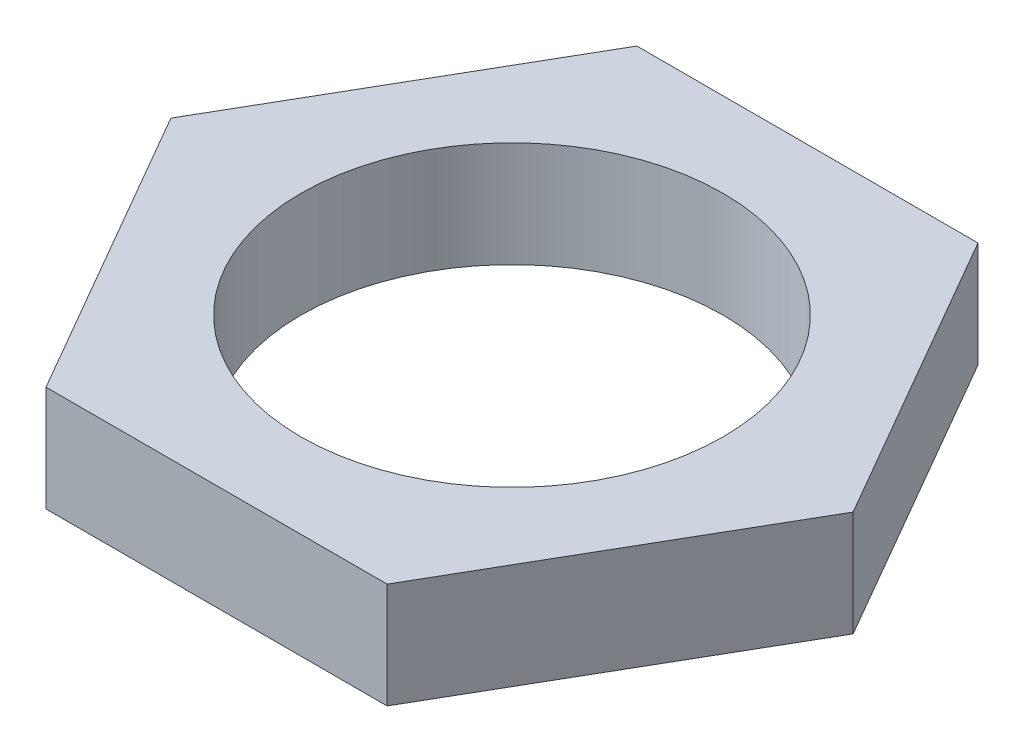
ISO-10303-21;
HEADER;
FILE_DESCRIPTION(('STEP AP214'),'2;1');
FILE_NAME('part.step','',(''),(''),'','','');
FILE_SCHEMA(('AUTOMOTIVE_DESIGN { 1 0 10303 214 1 1 1 1 }'));
ENDSEC;
DATA;
#1=APPLICATION_CONTEXT('core data for automotive mechanical design processes');
#2=APPLICATION_PROTOCOL_DEFINITION('international standard','automotive_design',2000,#1);
#3=PRODUCT_CONTEXT('',#1,'mechanical');
#4=PRODUCT('Part','Part','',(#3));
#5=PRODUCT_RELATED_PRODUCT_CATEGORY('part','',(#4));
#6=PRODUCT_DEFINITION_FORMATION('','',#4);
#7=PRODUCT_DEFINITION_CONTEXT('part definition',#1,'design');
#8=PRODUCT_DEFINITION('design','',#6,#7);
#9=PRODUCT_DEFINITION_SHAPE('','',#8);
#10=(LENGTH_UNIT() NAMED_UNIT(*) SI_UNIT(.MILLI.,.METRE.));
#11=(NAMED_UNIT(*) PLANE_ANGLE_UNIT() SI_UNIT($,.RADIAN.));
#12=(NAMED_UNIT(*) SI_UNIT($,.STERADIAN.) SOLID_ANGLE_UNIT());
#13=UNCERTAINTY_MEASURE_WITH_UNIT(LENGTH_MEASURE(1.E-05),#10,'distance_accuracy_value','');
#14=(GEOMETRIC_REPRESENTATION_CONTEXT(3) GLOBAL_UNCERTAINTY_ASSIGNED_CONTEXT((#13)) GLOBAL_UNIT_ASSIGNED_CONTEXT((#10,
#11,#12)) REPRESENTATION_CONTEXT('',''));
#15=CARTESIAN_POINT('',(0.,0.,0.));
#16=DIRECTION('',(0.,0.,1.));
#17=DIRECTION('',(1.,0.,0.));
#18=AXIS2_PLACEMENT_3D('',#15,#16,#17);
#19=CARTESIAN_POINT('',(0.,1.25,0.));
#20=DIRECTION('',(0.,1.,0.));
#21=DIRECTION('',(0.,0.,1.));
#22=AXIS2_PLACEMENT_3D('',#19,#20,#21);
#23=PLANE('',#22);
#24=DIRECTION('',(0.499999999999995,0.,-0.866025403784441));
#25=VECTOR('',#24,1.);
#26=CARTESIAN_POINT('',(4.04145188432746,1.25,6.99999999999996));
#27=LINE('',#26,#25);
#28=CARTESIAN_POINT('',(4.04145188432746,1.25,6.99999999999996));
#29=VERTEX_POINT('',#28);
#30=CARTESIAN_POINT('',(8.08290376865476,1.25,0.));
#31=VERTEX_POINT('',#30);
#32=EDGE_CURVE('E126',#29,#31,#27,.T.);
#33=ORIENTED_EDGE('',*,*,#32,.T.);
#34=DIRECTION('',(-0.500000000000001,0.,-0.866025403784438));
#35=VECTOR('',#34,1.);
#36=CARTESIAN_POINT('',(8.08290376865476,1.25,0.));
#37=LINE('',#36,#35);
#38=CARTESIAN_POINT('',(4.04145188432737,1.25,-7.00000000000001));
#39=VERTEX_POINT('',#38);
#40=EDGE_CURVE('E84',#31,#39,#37,.T.);
#41=ORIENTED_EDGE('',*,*,#40,.T.);
#42=DIRECTION('',(-1.,0.,0.));
#43=VECTOR('',#42,1.);
#44=CARTESIAN_POINT('',(4.04145188432737,1.25,-7.00000000000001));
#45=LINE('',#44,#43);
#46=CARTESIAN_POINT('',(-4.04145188432742,1.25,-6.99999999999998));
#47=VERTEX_POINT('',#46);
#48=EDGE_CURVE('E97',#39,#47,#45,.T.);
#49=ORIENTED_EDGE('',*,*,#48,.T.);
#50=DIRECTION('',(-0.499999999999995,0.,0.866025403784441));
#51=VECTOR('',#50,1.);
#52=CARTESIAN_POINT('',(-4.04145188432742,1.25,-6.99999999999998));
#53=LINE('',#52,#51);
#54=CARTESIAN_POINT('',(-8.08290376865476,1.25,0.));
#55=VERTEX_POINT('',#54);
#56=EDGE_CURVE('E91',#47,#55,#53,.T.);
#57=ORIENTED_EDGE('',*,*,#56,.T.);
#58=DIRECTION('',(0.500000000000007,0.,0.866025403784435));
#59=VECTOR('',#58,1.);
#60=CARTESIAN_POINT('',(-8.08290376865476,1.25,0.));
#61=LINE('',#60,#59);
#62=CARTESIAN_POINT('',(-4.04145188432732,1.25,7.00000000000004));
#63=VERTEX_POINT('',#62);
#64=EDGE_CURVE('E95',#55,#63,#61,.T.);
#65=ORIENTED_EDGE('',*,*,#64,.T.);
#66=DIRECTION('',(1.,0.,0.));
#67=VECTOR('',#66,1.);
#68=CARTESIAN_POINT('',(-4.04145188432732,1.25,7.00000000000004));
#69=LINE('',#68,#67);
#70=EDGE_CURVE('E47',#63,#29,#69,.T.);
#71=ORIENTED_EDGE('',*,*,#70,.T.);
#72=EDGE_LOOP('',(#33,#41,#49,#57,#65,#71));
#73=FACE_BOUND('',#72,.T.);
#74=CARTESIAN_POINT('',(0.,1.25,0.));
#75=DIRECTION('',(0.,1.,0.));
#76=DIRECTION('',(0.,0.,1.));
#77=AXIS2_PLACEMENT_3D('',#74,#75,#76);
#78=CIRCLE('',#77,5.);
#79=CARTESIAN_POINT('',(0.,1.25,5.));
#80=VERTEX_POINT('',#79);
#81=EDGE_CURVE('E119',#80,#80,#78,.T.);
#82=ORIENTED_EDGE('',*,*,#81,.F.);
#83=EDGE_LOOP('',(#82));
#84=FACE_BOUND('',#83,.T.);
#85=ADVANCED_FACE('F30',(#73,#84),#23,.T.);
#86=CARTESIAN_POINT('',(0.,-1.25,0.));
#87=DIRECTION('',(0.,1.,0.));
#88=DIRECTION('',(0.,0.,1.));
#89=AXIS2_PLACEMENT_3D('',#86,#87,#88);
#90=PLANE('',#89);
#91=DIRECTION('',(0.499999999999995,0.,-0.866025403784441));
#92=VECTOR('',#91,1.);
#93=CARTESIAN_POINT('',(4.04145188432746,-1.25,6.99999999999996));
#94=LINE('',#93,#92);
#95=CARTESIAN_POINT('',(4.04145188432746,-1.25,6.99999999999996));
#96=VERTEX_POINT('',#95);
#97=CARTESIAN_POINT('',(8.08290376865476,-1.25,0.));
#98=VERTEX_POINT('',#97);
#99=EDGE_CURVE('E115',#96,#98,#94,.T.);
#100=ORIENTED_EDGE('',*,*,#99,.F.);
#101=DIRECTION('',(1.,0.,0.));
#102=VECTOR('',#101,1.);
#103=CARTESIAN_POINT('',(-4.04145188432732,-1.25,7.00000000000004));
#104=LINE('',#103,#102);
#105=CARTESIAN_POINT('',(-4.04145188432732,-1.25,7.00000000000004));
#106=VERTEX_POINT('',#105);
#107=EDGE_CURVE('E76',#106,#96,#104,.T.);
#108=ORIENTED_EDGE('',*,*,#107,.F.);
#109=DIRECTION('',(0.500000000000007,0.,0.866025403784435));
#110=VECTOR('',#109,1.);
#111=CARTESIAN_POINT('',(-8.08290376865476,-1.25,0.));
#112=LINE('',#111,#110);
#113=CARTESIAN_POINT('',(-8.08290376865476,-1.25,0.));
#114=VERTEX_POINT('',#113);
#115=EDGE_CURVE('E70',#114,#106,#112,.T.);
#116=ORIENTED_EDGE('',*,*,#115,.F.);
#117=DIRECTION('',(-0.499999999999995,0.,0.866025403784441));
#118=VECTOR('',#117,1.);
#119=CARTESIAN_POINT('',(-4.04145188432742,-1.25,-6.99999999999998));
#120=LINE('',#119,#118);
#121=CARTESIAN_POINT('',(-4.04145188432742,-1.25,-6.99999999999998));
#122=VERTEX_POINT('',#121);
#123=EDGE_CURVE('E105',#122,#114,#120,.T.);
#124=ORIENTED_EDGE('',*,*,#123,.F.);
#125=DIRECTION('',(-1.,0.,0.));
#126=VECTOR('',#125,1.);
#127=CARTESIAN_POINT('',(4.04145188432737,-1.25,-7.00000000000001));
#128=LINE('',#127,#126);
#129=CARTESIAN_POINT('',(4.04145188432737,-1.25,-7.00000000000001));
#130=VERTEX_POINT('',#129);
#131=EDGE_CURVE('E121',#130,#122,#128,.T.);
#132=ORIENTED_EDGE('',*,*,#131,.F.);
#133=DIRECTION('',(-0.500000000000001,0.,-0.866025403784438));
#134=VECTOR('',#133,1.);
#135=CARTESIAN_POINT('',(8.08290376865476,-1.25,0.));
#136=LINE('',#135,#134);
#137=EDGE_CURVE('E118',#98,#130,#136,.T.);
#138=ORIENTED_EDGE('',*,*,#137,.F.);
#139=EDGE_LOOP('',(#100,#108,#116,#124,#132,#138));
#140=FACE_BOUND('',#139,.T.);
#141=CARTESIAN_POINT('',(0.,-1.25,0.));
#142=DIRECTION('',(0.,1.,0.));
#143=DIRECTION('',(0.,0.,1.));
#144=AXIS2_PLACEMENT_3D('',#141,#142,#143);
#145=CIRCLE('',#144,5.);
#146=CARTESIAN_POINT('',(0.,-1.25,5.));
#147=VERTEX_POINT('',#146);
#148=EDGE_CURVE('E219',#147,#147,#145,.T.);
#149=ORIENTED_EDGE('',*,*,#148,.T.);
#150=EDGE_LOOP('',(#149));
#151=FACE_BOUND('',#150,.T.);
#152=ADVANCED_FACE('F135',(#140,#151),#90,.F.);
#153=CARTESIAN_POINT('',(4.04145188432746,1.25,6.99999999999996));
#154=DIRECTION('',(-0.866025403784442,0.,-0.499999999999995));
#155=DIRECTION('',(-0.499999999999995,0.,0.866025403784442));
#156=AXIS2_PLACEMENT_3D('',#153,#154,#155);
#157=PLANE('',#156);
#158=ORIENTED_EDGE('',*,*,#99,.T.);
#159=DIRECTION('',(0.,-1.,0.));
#160=VECTOR('',#159,1.);
#161=CARTESIAN_POINT('',(8.08290376865476,1.25,0.));
#162=LINE('',#161,#160);
#163=EDGE_CURVE('E11',#31,#98,#162,.T.);
#164=ORIENTED_EDGE('',*,*,#163,.F.);
#165=ORIENTED_EDGE('',*,*,#32,.F.);
#166=DIRECTION('',(0.,-1.,0.));
#167=VECTOR('',#166,1.);
#168=CARTESIAN_POINT('',(4.04145188432746,1.25,6.99999999999996));
#169=LINE('',#168,#167);
#170=EDGE_CURVE('E111',#29,#96,#169,.T.);
#171=ORIENTED_EDGE('',*,*,#170,.T.);
#172=EDGE_LOOP('',(#158,#164,#165,#171));
#173=FACE_BOUND('',#172,.T.);
#174=ADVANCED_FACE('F32',(#173),#157,.F.);
#175=CARTESIAN_POINT('',(8.08290376865476,1.25,0.));
#176=DIRECTION('',(-0.866025403784438,0.,0.500000000000001));
#177=DIRECTION('',(0.500000000000001,0.,0.866025403784438));
#178=AXIS2_PLACEMENT_3D('',#175,#176,#177);
#179=PLANE('',#178);
#180=ORIENTED_EDGE('',*,*,#137,.T.);
#181=DIRECTION('',(0.,-1.,0.));
#182=VECTOR('',#181,1.);
#183=CARTESIAN_POINT('',(4.04145188432737,1.25,-7.00000000000001));
#184=LINE('',#183,#182);
#185=EDGE_CURVE('E39',#39,#130,#184,.T.);
#186=ORIENTED_EDGE('',*,*,#185,.F.);
#187=ORIENTED_EDGE('',*,*,#40,.F.);
#188=ORIENTED_EDGE('',*,*,#163,.T.);
#189=EDGE_LOOP('',(#180,#186,#187,#188));
#190=FACE_BOUND('',#189,.T.);
#191=ADVANCED_FACE('F160',(#190),#179,.F.);
#192=CARTESIAN_POINT('',(4.04145188432737,1.25,-7.00000000000001));
#193=DIRECTION('',(0.,0.,1.));
#194=DIRECTION('',(1.,0.,0.));
#195=AXIS2_PLACEMENT_3D('',#192,#193,#194);
#196=PLANE('',#195);
#197=ORIENTED_EDGE('',*,*,#131,.T.);
#198=DIRECTION('',(0.,-1.,0.));
#199=VECTOR('',#198,1.);
#200=CARTESIAN_POINT('',(-4.04145188432742,1.25,-6.99999999999998));
#201=LINE('',#200,#199);
#202=EDGE_CURVE('E106',#47,#122,#201,.T.);
#203=ORIENTED_EDGE('',*,*,#202,.F.);
#204=ORIENTED_EDGE('',*,*,#48,.F.);
#205=ORIENTED_EDGE('',*,*,#185,.T.);
#206=EDGE_LOOP('',(#197,#203,#204,#205));
#207=FACE_BOUND('',#206,.T.);
#208=ADVANCED_FACE('F132',(#207),#196,.F.);
#209=CARTESIAN_POINT('',(-4.04145188432742,1.25,-6.99999999999998));
#210=DIRECTION('',(0.866025403784441,0.,0.499999999999995));
#211=DIRECTION('',(0.499999999999995,0.,-0.866025403784441));
#212=AXIS2_PLACEMENT_3D('',#209,#210,#211);
#213=PLANE('',#212);
#214=ORIENTED_EDGE('',*,*,#123,.T.);
#215=DIRECTION('',(0.,-1.,0.));
#216=VECTOR('',#215,1.);
#217=CARTESIAN_POINT('',(-8.08290376865476,1.25,0.));
#218=LINE('',#217,#216);
#219=EDGE_CURVE('E102',#55,#114,#218,.T.);
#220=ORIENTED_EDGE('',*,*,#219,.F.);
#221=ORIENTED_EDGE('',*,*,#56,.F.);
#222=ORIENTED_EDGE('',*,*,#202,.T.);
#223=EDGE_LOOP('',(#214,#220,#221,#222));
#224=FACE_BOUND('',#223,.T.);
#225=ADVANCED_FACE('F103',(#224),#213,.F.);
#226=CARTESIAN_POINT('',(-8.08290376865476,1.25,0.));
#227=DIRECTION('',(0.866025403784434,0.,-0.500000000000007));
#228=DIRECTION('',(-0.500000000000007,0.,-0.866025403784435));
#229=AXIS2_PLACEMENT_3D('',#226,#227,#228);
#230=PLANE('',#229);
#231=ORIENTED_EDGE('',*,*,#115,.T.);
#232=DIRECTION('',(0.,-1.,0.));
#233=VECTOR('',#232,1.);
#234=CARTESIAN_POINT('',(-4.04145188432732,1.25,7.00000000000004));
#235=LINE('',#234,#233);
#236=EDGE_CURVE('E107',#63,#106,#235,.T.);
#237=ORIENTED_EDGE('',*,*,#236,.F.);
#238=ORIENTED_EDGE('',*,*,#64,.F.);
#239=ORIENTED_EDGE('',*,*,#219,.T.);
#240=EDGE_LOOP('',(#231,#237,#238,#239));
#241=FACE_BOUND('',#240,.T.);
#242=ADVANCED_FACE('F109',(#241),#230,.F.);
#243=CARTESIAN_POINT('',(-4.04145188432732,1.25,7.00000000000004));
#244=DIRECTION('',(0.,0.,-1.));
#245=DIRECTION('',(-1.,0.,0.));
#246=AXIS2_PLACEMENT_3D('',#243,#244,#245);
#247=PLANE('',#246);
#248=ORIENTED_EDGE('',*,*,#107,.T.);
#249=ORIENTED_EDGE('',*,*,#170,.F.);
#250=ORIENTED_EDGE('',*,*,#70,.F.);
#251=ORIENTED_EDGE('',*,*,#236,.T.);
#252=EDGE_LOOP('',(#248,#249,#250,#251));
#253=FACE_BOUND('',#252,.T.);
#254=ADVANCED_FACE('F140',(#253),#247,.F.);
#255=CARTESIAN_POINT('',(0.,1.25,0.));
#256=DIRECTION('',(0.,-1.,0.));
#257=DIRECTION('',(0.,0.,-1.));
#258=AXIS2_PLACEMENT_3D('',#255,#256,#257);
#259=CYLINDRICAL_SURFACE('',#258,5.);
#260=ORIENTED_EDGE('',*,*,#81,.T.);
#261=EDGE_LOOP('',(#260));
#262=FACE_BOUND('',#261,.T.);
#263=ORIENTED_EDGE('',*,*,#148,.F.);
#264=EDGE_LOOP('',(#263));
#265=FACE_BOUND('',#264,.T.);
#266=ADVANCED_FACE('F142',(#262,#265),#259,.F.);
#267=CLOSED_SHELL('',(#85,#152,#174,#191,#208,#225,#242,#254,#266));
#268=MANIFOLD_SOLID_BREP('B2',#267);
#269=ADVANCED_BREP_SHAPE_REPRESENTATION('',(#18,#268),#14);
#270=SHAPE_DEFINITION_REPRESENTATION(#9,#269);
ENDSEC;
END-ISO-10303-21;
